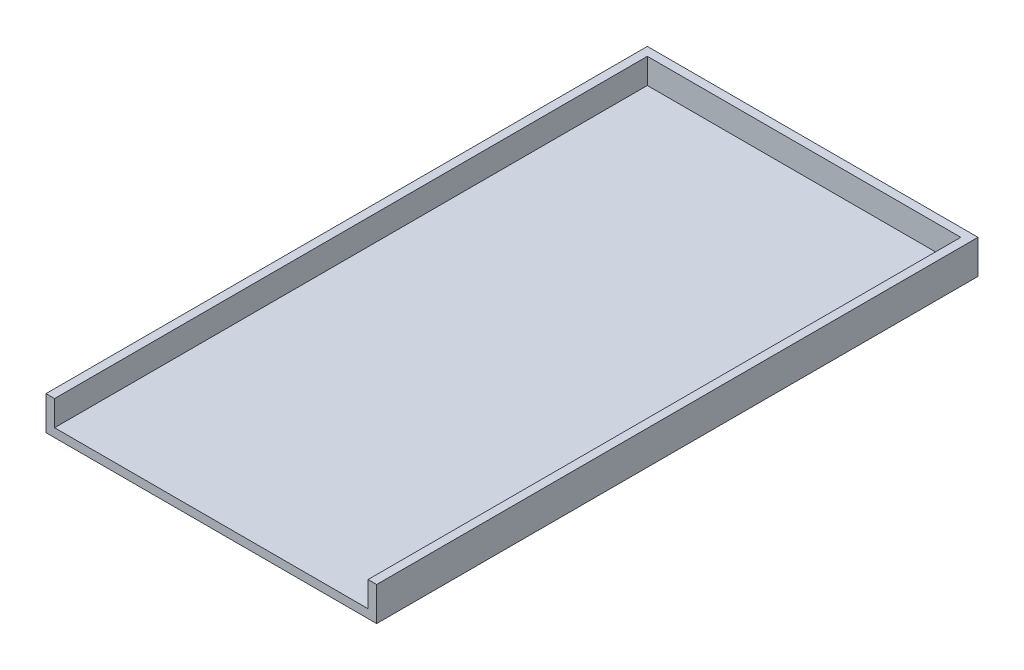
ISO-10303-21;
HEADER;
FILE_DESCRIPTION(('STEP AP214'),'2;1');
FILE_NAME('part.step','',(''),(''),'','','');
FILE_SCHEMA(('AUTOMOTIVE_DESIGN { 1 0 10303 214 1 1 1 1 }'));
ENDSEC;
DATA;
#1=APPLICATION_CONTEXT('core data for automotive mechanical design processes');
#2=APPLICATION_PROTOCOL_DEFINITION('international standard','automotive_design',2000,#1);
#3=PRODUCT_CONTEXT('',#1,'mechanical');
#4=PRODUCT('Part','Part','',(#3));
#5=PRODUCT_RELATED_PRODUCT_CATEGORY('part','',(#4));
#6=PRODUCT_DEFINITION_FORMATION('','',#4);
#7=PRODUCT_DEFINITION_CONTEXT('part definition',#1,'design');
#8=PRODUCT_DEFINITION('design','',#6,#7);
#9=PRODUCT_DEFINITION_SHAPE('','',#8);
#10=(LENGTH_UNIT() NAMED_UNIT(*) SI_UNIT(.MILLI.,.METRE.));
#11=(NAMED_UNIT(*) PLANE_ANGLE_UNIT() SI_UNIT($,.RADIAN.));
#12=(NAMED_UNIT(*) SI_UNIT($,.STERADIAN.) SOLID_ANGLE_UNIT());
#13=UNCERTAINTY_MEASURE_WITH_UNIT(LENGTH_MEASURE(1.E-05),#10,'distance_accuracy_value','');
#14=(GEOMETRIC_REPRESENTATION_CONTEXT(3) GLOBAL_UNCERTAINTY_ASSIGNED_CONTEXT((#13)) GLOBAL_UNIT_ASSIGNED_CONTEXT((#10,
#11,#12)) REPRESENTATION_CONTEXT('',''));
#15=CARTESIAN_POINT('',(0.,0.,0.));
#16=DIRECTION('',(0.,0.,1.));
#17=DIRECTION('',(1.,0.,0.));
#18=AXIS2_PLACEMENT_3D('',#15,#16,#17);
#19=CARTESIAN_POINT('',(0.,0.,222.25));
#20=DIRECTION('',(0.,0.,-1.));
#21=DIRECTION('',(-1.,0.,0.));
#22=AXIS2_PLACEMENT_3D('',#19,#20,#21);
#23=PLANE('',#22);
#24=DIRECTION('',(0.,1.,0.));
#25=VECTOR('',#24,1.);
#26=CARTESIAN_POINT('',(33.7784947871246,0.,222.25));
#27=LINE('',#26,#25);
#28=CARTESIAN_POINT('',(33.7784947871246,-62.7387987987747,222.25));
#29=VERTEX_POINT('',#28);
#30=CARTESIAN_POINT('',(33.7784947871246,-53.3932109594111,222.25));
#31=VERTEX_POINT('',#30);
#32=EDGE_CURVE('E147',#29,#31,#27,.T.);
#33=ORIENTED_EDGE('',*,*,#32,.F.);
#34=DIRECTION('',(1.,0.,0.));
#35=VECTOR('',#34,1.);
#36=CARTESIAN_POINT('',(0.,-62.7387987987747,222.25));
#37=LINE('',#36,#35);
#38=CARTESIAN_POINT('',(-82.0732634805252,-62.7387987987747,222.25));
#39=VERTEX_POINT('',#38);
#40=EDGE_CURVE('E134',#39,#29,#37,.T.);
#41=ORIENTED_EDGE('',*,*,#40,.F.);
#42=DIRECTION('',(0.,-1.,0.));
#43=VECTOR('',#42,1.);
#44=CARTESIAN_POINT('',(-82.0732634805252,0.,222.25));
#45=LINE('',#44,#43);
#46=CARTESIAN_POINT('',(-82.0732634805251,-53.3932109594111,222.25));
#47=VERTEX_POINT('',#46);
#48=EDGE_CURVE('E143',#47,#39,#45,.T.);
#49=ORIENTED_EDGE('',*,*,#48,.F.);
#50=DIRECTION('',(-1.,0.,0.));
#51=VECTOR('',#50,1.);
#52=CARTESIAN_POINT('',(36.9534947871246,-53.3932109594111,222.25));
#53=LINE('',#52,#51);
#54=CARTESIAN_POINT('',(-85.2482634805252,-53.3932109594111,222.25));
#55=VERTEX_POINT('',#54);
#56=EDGE_CURVE('E156',#47,#55,#53,.T.);
#57=ORIENTED_EDGE('',*,*,#56,.T.);
#58=DIRECTION('',(0.,-1.,0.));
#59=VECTOR('',#58,1.);
#60=CARTESIAN_POINT('',(-85.2482634805252,-65.9137987987747,222.25));
#61=LINE('',#60,#59);
#62=CARTESIAN_POINT('',(-85.2482634805252,-65.9137987987747,222.25));
#63=VERTEX_POINT('',#62);
#64=EDGE_CURVE('E65',#55,#63,#61,.T.);
#65=ORIENTED_EDGE('',*,*,#64,.T.);
#66=DIRECTION('',(1.,0.,0.));
#67=VECTOR('',#66,1.);
#68=CARTESIAN_POINT('',(36.9534947871246,-65.9137987987747,222.25));
#69=LINE('',#68,#67);
#70=CARTESIAN_POINT('',(36.9534947871246,-65.9137987987747,222.25));
#71=VERTEX_POINT('',#70);
#72=EDGE_CURVE('E153',#63,#71,#69,.T.);
#73=ORIENTED_EDGE('',*,*,#72,.T.);
#74=DIRECTION('',(0.,1.,0.));
#75=VECTOR('',#74,1.);
#76=CARTESIAN_POINT('',(36.9534947871246,-65.9137987987747,222.25));
#77=LINE('',#76,#75);
#78=CARTESIAN_POINT('',(36.9534947871246,-53.3932109594111,222.25));
#79=VERTEX_POINT('',#78);
#80=EDGE_CURVE('E93',#71,#79,#77,.T.);
#81=ORIENTED_EDGE('',*,*,#80,.T.);
#82=EDGE_CURVE('E157',#79,#31,#53,.T.);
#83=ORIENTED_EDGE('',*,*,#82,.T.);
#84=EDGE_LOOP('',(#33,#41,#49,#57,#65,#73,#81,#83));
#85=FACE_BOUND('',#84,.T.);
#86=ADVANCED_FACE('F41',(#85),#23,.F.);
#87=CARTESIAN_POINT('',(36.9534947871246,-65.9137987987747,222.25));
#88=DIRECTION('',(0.,1.,0.));
#89=DIRECTION('',(-1.,0.,0.));
#90=AXIS2_PLACEMENT_3D('',#87,#88,#89);
#91=PLANE('',#90);
#92=DIRECTION('',(1.,0.,0.));
#93=VECTOR('',#92,1.);
#94=CARTESIAN_POINT('',(36.9534947871246,-65.9137987987747,0.));
#95=LINE('',#94,#93);
#96=CARTESIAN_POINT('',(-85.2482634805252,-65.9137987987747,0.));
#97=VERTEX_POINT('',#96);
#98=CARTESIAN_POINT('',(36.9534947871246,-65.9137987987747,0.));
#99=VERTEX_POINT('',#98);
#100=EDGE_CURVE('E135',#97,#99,#95,.T.);
#101=ORIENTED_EDGE('',*,*,#100,.T.);
#102=DIRECTION('',(0.,0.,-1.));
#103=VECTOR('',#102,1.);
#104=CARTESIAN_POINT('',(36.9534947871246,-65.9137987987747,222.25));
#105=LINE('',#104,#103);
#106=EDGE_CURVE('E11',#71,#99,#105,.T.);
#107=ORIENTED_EDGE('',*,*,#106,.F.);
#108=ORIENTED_EDGE('',*,*,#72,.F.);
#109=DIRECTION('',(0.,0.,-1.));
#110=VECTOR('',#109,1.);
#111=CARTESIAN_POINT('',(-85.2482634805252,-65.9137987987747,222.25));
#112=LINE('',#111,#110);
#113=EDGE_CURVE('E161',#63,#97,#112,.T.);
#114=ORIENTED_EDGE('',*,*,#113,.T.);
#115=EDGE_LOOP('',(#101,#107,#108,#114));
#116=FACE_BOUND('',#115,.T.);
#117=ADVANCED_FACE('F43',(#116),#91,.F.);
#118=CARTESIAN_POINT('',(36.9534947871246,-65.9137987987747,222.25));
#119=DIRECTION('',(-1.,0.,0.));
#120=DIRECTION('',(0.,0.,1.));
#121=AXIS2_PLACEMENT_3D('',#118,#119,#120);
#122=PLANE('',#121);
#123=DIRECTION('',(0.,1.,0.));
#124=VECTOR('',#123,1.);
#125=CARTESIAN_POINT('',(36.9534947871246,-65.9137987987747,0.));
#126=LINE('',#125,#124);
#127=CARTESIAN_POINT('',(36.9534947871246,-53.3932109594111,0.));
#128=VERTEX_POINT('',#127);
#129=EDGE_CURVE('E164',#99,#128,#126,.T.);
#130=ORIENTED_EDGE('',*,*,#129,.T.);
#131=DIRECTION('',(0.,0.,-1.));
#132=VECTOR('',#131,1.);
#133=CARTESIAN_POINT('',(36.9534947871246,-53.3932109594111,222.25));
#134=LINE('',#133,#132);
#135=EDGE_CURVE('E49',#79,#128,#134,.T.);
#136=ORIENTED_EDGE('',*,*,#135,.F.);
#137=ORIENTED_EDGE('',*,*,#80,.F.);
#138=ORIENTED_EDGE('',*,*,#106,.T.);
#139=EDGE_LOOP('',(#130,#136,#137,#138));
#140=FACE_BOUND('',#139,.T.);
#141=ADVANCED_FACE('F201',(#140),#122,.F.);
#142=CARTESIAN_POINT('',(36.9534947871246,-53.3932109594111,222.25));
#143=DIRECTION('',(0.,-1.,0.));
#144=DIRECTION('',(0.,0.,-1.));
#145=AXIS2_PLACEMENT_3D('',#142,#143,#144);
#146=PLANE('',#145);
#147=ORIENTED_EDGE('',*,*,#56,.F.);
#148=DIRECTION('',(0.,0.,-1.));
#149=VECTOR('',#148,1.);
#150=CARTESIAN_POINT('',(-82.0732634805252,-53.3932109594111,222.25));
#151=LINE('',#150,#149);
#152=CARTESIAN_POINT('',(-82.0732634805252,-53.3932109594111,3.175));
#153=VERTEX_POINT('',#152);
#154=EDGE_CURVE('E56',#47,#153,#151,.T.);
#155=ORIENTED_EDGE('',*,*,#154,.T.);
#156=DIRECTION('',(-1.,0.,0.));
#157=VECTOR('',#156,1.);
#158=CARTESIAN_POINT('',(0.,-53.3932109594111,3.175));
#159=LINE('',#158,#157);
#160=CARTESIAN_POINT('',(33.7784947871246,-53.3932109594111,3.175));
#161=VERTEX_POINT('',#160);
#162=EDGE_CURVE('E126',#161,#153,#159,.T.);
#163=ORIENTED_EDGE('',*,*,#162,.F.);
#164=DIRECTION('',(0.,0.,-1.));
#165=VECTOR('',#164,1.);
#166=CARTESIAN_POINT('',(33.7784947871246,-53.3932109594111,222.25));
#167=LINE('',#166,#165);
#168=EDGE_CURVE('E122',#31,#161,#167,.T.);
#169=ORIENTED_EDGE('',*,*,#168,.F.);
#170=ORIENTED_EDGE('',*,*,#82,.F.);
#171=ORIENTED_EDGE('',*,*,#135,.T.);
#172=DIRECTION('',(-1.,0.,0.));
#173=VECTOR('',#172,1.);
#174=CARTESIAN_POINT('',(36.9534947871246,-53.3932109594111,0.));
#175=LINE('',#174,#173);
#176=CARTESIAN_POINT('',(-85.2482634805252,-53.3932109594111,0.));
#177=VERTEX_POINT('',#176);
#178=EDGE_CURVE('E166',#128,#177,#175,.T.);
#179=ORIENTED_EDGE('',*,*,#178,.T.);
#180=DIRECTION('',(0.,0.,-1.));
#181=VECTOR('',#180,1.);
#182=CARTESIAN_POINT('',(-85.2482634805252,-53.3932109594111,222.25));
#183=LINE('',#182,#181);
#184=EDGE_CURVE('E170',#55,#177,#183,.T.);
#185=ORIENTED_EDGE('',*,*,#184,.F.);
#186=EDGE_LOOP('',(#147,#155,#163,#169,#170,#171,#179,#185));
#187=FACE_BOUND('',#186,.T.);
#188=ADVANCED_FACE('F176',(#187),#146,.F.);
#189=CARTESIAN_POINT('',(-85.2482634805252,-65.9137987987747,222.25));
#190=DIRECTION('',(1.,0.,0.));
#191=DIRECTION('',(0.,0.,-1.));
#192=AXIS2_PLACEMENT_3D('',#189,#190,#191);
#193=PLANE('',#192);
#194=DIRECTION('',(0.,-1.,0.));
#195=VECTOR('',#194,1.);
#196=CARTESIAN_POINT('',(-85.2482634805252,-65.9137987987747,0.));
#197=LINE('',#196,#195);
#198=EDGE_CURVE('E86',#177,#97,#197,.T.);
#199=ORIENTED_EDGE('',*,*,#198,.T.);
#200=ORIENTED_EDGE('',*,*,#113,.F.);
#201=ORIENTED_EDGE('',*,*,#64,.F.);
#202=ORIENTED_EDGE('',*,*,#184,.T.);
#203=EDGE_LOOP('',(#199,#200,#201,#202));
#204=FACE_BOUND('',#203,.T.);
#205=ADVANCED_FACE('F184',(#204),#193,.F.);
#206=CARTESIAN_POINT('',(0.,0.,0.));
#207=DIRECTION('',(0.,0.,-1.));
#208=DIRECTION('',(-1.,0.,0.));
#209=AXIS2_PLACEMENT_3D('',#206,#207,#208);
#210=PLANE('',#209);
#211=ORIENTED_EDGE('',*,*,#100,.F.);
#212=ORIENTED_EDGE('',*,*,#198,.F.);
#213=ORIENTED_EDGE('',*,*,#178,.F.);
#214=ORIENTED_EDGE('',*,*,#129,.F.);
#215=EDGE_LOOP('',(#211,#212,#213,#214));
#216=FACE_BOUND('',#215,.T.);
#217=ADVANCED_FACE('F180',(#216),#210,.T.);
#218=CARTESIAN_POINT('',(36.9534947871246,-62.7387987987747,222.25));
#219=DIRECTION('',(0.,1.,0.));
#220=DIRECTION('',(-1.,0.,0.));
#221=AXIS2_PLACEMENT_3D('',#218,#219,#220);
#222=PLANE('',#221);
#223=DIRECTION('',(1.,0.,0.));
#224=VECTOR('',#223,1.);
#225=CARTESIAN_POINT('',(0.,-62.7387987987747,3.175));
#226=LINE('',#225,#224);
#227=CARTESIAN_POINT('',(-82.0732634805252,-62.7387987987747,3.175));
#228=VERTEX_POINT('',#227);
#229=CARTESIAN_POINT('',(33.7784947871246,-62.7387987987747,3.175));
#230=VERTEX_POINT('',#229);
#231=EDGE_CURVE('E127',#228,#230,#226,.T.);
#232=ORIENTED_EDGE('',*,*,#231,.F.);
#233=DIRECTION('',(0.,0.,-1.));
#234=VECTOR('',#233,1.);
#235=CARTESIAN_POINT('',(-82.0732634805252,-62.7387987987747,222.25));
#236=LINE('',#235,#234);
#237=EDGE_CURVE('E142',#39,#228,#236,.T.);
#238=ORIENTED_EDGE('',*,*,#237,.F.);
#239=ORIENTED_EDGE('',*,*,#40,.T.);
#240=DIRECTION('',(0.,0.,-1.));
#241=VECTOR('',#240,1.);
#242=CARTESIAN_POINT('',(33.7784947871246,-62.7387987987747,222.25));
#243=LINE('',#242,#241);
#244=EDGE_CURVE('E119',#29,#230,#243,.T.);
#245=ORIENTED_EDGE('',*,*,#244,.T.);
#246=EDGE_LOOP('',(#232,#238,#239,#245));
#247=FACE_BOUND('',#246,.T.);
#248=ADVANCED_FACE('F131',(#247),#222,.T.);
#249=CARTESIAN_POINT('',(33.7784947871246,-65.9137987987747,222.25));
#250=DIRECTION('',(-1.,0.,0.));
#251=DIRECTION('',(0.,0.,1.));
#252=AXIS2_PLACEMENT_3D('',#249,#250,#251);
#253=PLANE('',#252);
#254=DIRECTION('',(0.,1.,0.));
#255=VECTOR('',#254,1.);
#256=CARTESIAN_POINT('',(33.7784947871246,0.,3.175));
#257=LINE('',#256,#255);
#258=EDGE_CURVE('E116',#230,#161,#257,.T.);
#259=ORIENTED_EDGE('',*,*,#258,.F.);
#260=ORIENTED_EDGE('',*,*,#244,.F.);
#261=ORIENTED_EDGE('',*,*,#32,.T.);
#262=ORIENTED_EDGE('',*,*,#168,.T.);
#263=EDGE_LOOP('',(#259,#260,#261,#262));
#264=FACE_BOUND('',#263,.T.);
#265=ADVANCED_FACE('F118',(#264),#253,.T.);
#266=CARTESIAN_POINT('',(-82.0732634805252,-65.9137987987747,222.25));
#267=DIRECTION('',(1.,0.,0.));
#268=DIRECTION('',(0.,0.,-1.));
#269=AXIS2_PLACEMENT_3D('',#266,#267,#268);
#270=PLANE('',#269);
#271=DIRECTION('',(0.,-1.,0.));
#272=VECTOR('',#271,1.);
#273=CARTESIAN_POINT('',(-82.0732634805252,0.,3.175));
#274=LINE('',#273,#272);
#275=EDGE_CURVE('E138',#153,#228,#274,.T.);
#276=ORIENTED_EDGE('',*,*,#275,.F.);
#277=ORIENTED_EDGE('',*,*,#154,.F.);
#278=ORIENTED_EDGE('',*,*,#48,.T.);
#279=ORIENTED_EDGE('',*,*,#237,.T.);
#280=EDGE_LOOP('',(#276,#277,#278,#279));
#281=FACE_BOUND('',#280,.T.);
#282=ADVANCED_FACE('F185',(#281),#270,.T.);
#283=CARTESIAN_POINT('',(0.,0.,3.175));
#284=DIRECTION('',(0.,0.,-1.));
#285=DIRECTION('',(-1.,0.,0.));
#286=AXIS2_PLACEMENT_3D('',#283,#284,#285);
#287=PLANE('',#286);
#288=ORIENTED_EDGE('',*,*,#231,.T.);
#289=ORIENTED_EDGE('',*,*,#258,.T.);
#290=ORIENTED_EDGE('',*,*,#162,.T.);
#291=ORIENTED_EDGE('',*,*,#275,.T.);
#292=EDGE_LOOP('',(#288,#289,#290,#291));
#293=FACE_BOUND('',#292,.T.);
#294=ADVANCED_FACE('F137',(#293),#287,.F.);
#295=CLOSED_SHELL('',(#86,#117,#141,#188,#205,#217,#248,#265,#282,#294));
#296=MANIFOLD_SOLID_BREP('B2',#295);
#297=ADVANCED_BREP_SHAPE_REPRESENTATION('',(#18,#296),#14);
#298=SHAPE_DEFINITION_REPRESENTATION(#9,#297);
ENDSEC;
END-ISO-10303-21;
